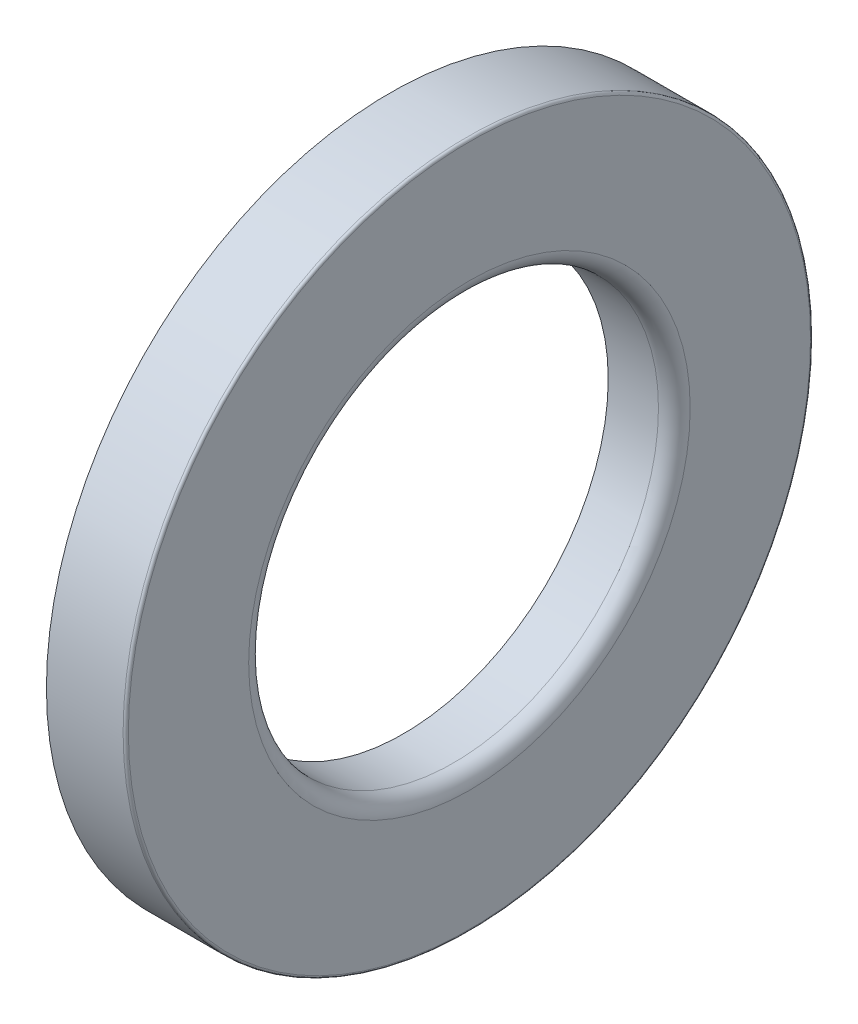
ISO-10303-21;
HEADER;
FILE_DESCRIPTION(('STEP AP214'),'2;1');
FILE_NAME('part.step','',(''),(''),'','','');
FILE_SCHEMA(('AUTOMOTIVE_DESIGN { 1 0 10303 214 1 1 1 1 }'));
ENDSEC;
DATA;
#1=APPLICATION_CONTEXT('core data for automotive mechanical design processes');
#2=APPLICATION_PROTOCOL_DEFINITION('international standard','automotive_design',2000,#1);
#3=PRODUCT_CONTEXT('',#1,'mechanical');
#4=PRODUCT('Part','Part','',(#3));
#5=PRODUCT_RELATED_PRODUCT_CATEGORY('part','',(#4));
#6=PRODUCT_DEFINITION_FORMATION('','',#4);
#7=PRODUCT_DEFINITION_CONTEXT('part definition',#1,'design');
#8=PRODUCT_DEFINITION('design','',#6,#7);
#9=PRODUCT_DEFINITION_SHAPE('','',#8);
#10=(LENGTH_UNIT() NAMED_UNIT(*) SI_UNIT(.MILLI.,.METRE.));
#11=(NAMED_UNIT(*) PLANE_ANGLE_UNIT() SI_UNIT($,.RADIAN.));
#12=(NAMED_UNIT(*) SI_UNIT($,.STERADIAN.) SOLID_ANGLE_UNIT());
#13=UNCERTAINTY_MEASURE_WITH_UNIT(LENGTH_MEASURE(1.E-05),#10,'distance_accuracy_value','');
#14=(GEOMETRIC_REPRESENTATION_CONTEXT(3) GLOBAL_UNCERTAINTY_ASSIGNED_CONTEXT((#13)) GLOBAL_UNIT_ASSIGNED_CONTEXT((#10,
#11,#12)) REPRESENTATION_CONTEXT('',''));
#15=CARTESIAN_POINT('',(0.,0.,0.));
#16=DIRECTION('',(0.,0.,1.));
#17=DIRECTION('',(1.,0.,0.));
#18=AXIS2_PLACEMENT_3D('',#15,#16,#17);
#19=CARTESIAN_POINT('',(-2.5,12.5,-1.11022302462516E-13));
#20=DIRECTION('',(1.,0.,0.));
#21=DIRECTION('',(0.,0.,-1.));
#22=AXIS2_PLACEMENT_3D('',#19,#20,#21);
#23=PLANE('',#22);
#24=CARTESIAN_POINT('',(-2.5,0.,-1.11022302462516E-13));
#25=DIRECTION('',(-1.,0.,0.));
#26=DIRECTION('',(0.,0.,1.));
#27=AXIS2_PLACEMENT_3D('',#24,#25,#26);
#28=CIRCLE('',#27,12.5);
#29=CARTESIAN_POINT('',(-2.5,0.,12.4999999999999));
#30=VERTEX_POINT('',#29);
#31=EDGE_CURVE('E10',#30,#30,#28,.T.);
#32=ORIENTED_EDGE('',*,*,#31,.F.);
#33=EDGE_LOOP('',(#32));
#34=FACE_BOUND('',#33,.T.);
#35=CARTESIAN_POINT('',(-2.5,0.,-1.11022302462516E-13));
#36=DIRECTION('',(-1.,0.,0.));
#37=DIRECTION('',(0.,0.,1.));
#38=AXIS2_PLACEMENT_3D('',#35,#36,#37);
#39=CIRCLE('',#38,13.);
#40=CARTESIAN_POINT('',(-2.5,0.,12.9999999999999));
#41=VERTEX_POINT('',#40);
#42=EDGE_CURVE('E64',#41,#41,#39,.T.);
#43=ORIENTED_EDGE('',*,*,#42,.T.);
#44=EDGE_LOOP('',(#43));
#45=FACE_BOUND('',#44,.T.);
#46=ADVANCED_FACE('F24',(#34,#45),#23,.F.);
#47=CARTESIAN_POINT('',(-5.95642479213908,0.,-2.22044604925031E-13));
#48=DIRECTION('',(-1.,0.,0.));
#49=DIRECTION('',(0.,0.,1.));
#50=AXIS2_PLACEMENT_3D('',#47,#48,#49);
#51=CYLINDRICAL_SURFACE('',#50,12.5);
#52=CARTESIAN_POINT('',(-0.5,0.,-1.11022302462516E-13));
#53=DIRECTION('',(-1.,0.,0.));
#54=DIRECTION('',(0.,0.,1.));
#55=AXIS2_PLACEMENT_3D('',#52,#53,#54);
#56=CIRCLE('',#55,12.5);
#57=CARTESIAN_POINT('',(-0.499999999999999,0.,12.4999999999999));
#58=VERTEX_POINT('',#57);
#59=EDGE_CURVE('E30',#58,#58,#56,.T.);
#60=ORIENTED_EDGE('',*,*,#59,.F.);
#61=EDGE_LOOP('',(#60));
#62=FACE_BOUND('',#61,.T.);
#63=ORIENTED_EDGE('',*,*,#31,.T.);
#64=EDGE_LOOP('',(#63));
#65=FACE_BOUND('',#64,.T.);
#66=ADVANCED_FACE('F125',(#62,#65),#51,.F.);
#67=CARTESIAN_POINT('',(-0.5,0.,-1.11022302462516E-13));
#68=DIRECTION('',(-1.,0.,0.));
#69=DIRECTION('',(0.,0.,1.));
#70=AXIS2_PLACEMENT_3D('',#67,#68,#69);
#71=TOROIDAL_SURFACE('',#70,12.,0.5);
#72=CARTESIAN_POINT('',(0.,0.,0.));
#73=DIRECTION('',(-1.,0.,0.));
#74=DIRECTION('',(0.,0.,1.));
#75=AXIS2_PLACEMENT_3D('',#72,#73,#74);
#76=CIRCLE('',#75,12.);
#77=CARTESIAN_POINT('',(0.,0.,12.));
#78=VERTEX_POINT('',#77);
#79=EDGE_CURVE('E34',#78,#78,#76,.T.);
#80=ORIENTED_EDGE('',*,*,#79,.F.);
#81=EDGE_LOOP('',(#80));
#82=FACE_BOUND('',#81,.T.);
#83=ORIENTED_EDGE('',*,*,#59,.T.);
#84=EDGE_LOOP('',(#83));
#85=FACE_BOUND('',#84,.T.);
#86=ADVANCED_FACE('F120',(#82,#85),#71,.F.);
#87=CARTESIAN_POINT('',(0.,8.75000000000001,-1.11022302462516E-13));
#88=DIRECTION('',(1.,0.,0.));
#89=DIRECTION('',(0.,0.,-1.));
#90=AXIS2_PLACEMENT_3D('',#87,#88,#89);
#91=PLANE('',#90);
#92=CARTESIAN_POINT('',(0.,0.,0.));
#93=DIRECTION('',(-1.,0.,0.));
#94=DIRECTION('',(0.,0.,1.));
#95=AXIS2_PLACEMENT_3D('',#92,#93,#94);
#96=CIRCLE('',#95,8.75);
#97=CARTESIAN_POINT('',(0.,0.,8.75000000000001));
#98=VERTEX_POINT('',#97);
#99=EDGE_CURVE('E38',#98,#98,#96,.T.);
#100=ORIENTED_EDGE('',*,*,#99,.F.);
#101=EDGE_LOOP('',(#100));
#102=FACE_BOUND('',#101,.T.);
#103=ORIENTED_EDGE('',*,*,#79,.T.);
#104=EDGE_LOOP('',(#103));
#105=FACE_BOUND('',#104,.T.);
#106=ADVANCED_FACE('F114',(#102,#105),#91,.F.);
#107=CARTESIAN_POINT('',(-0.5,0.,-1.11022302462516E-13));
#108=DIRECTION('',(-1.,0.,0.));
#109=DIRECTION('',(0.,0.,1.));
#110=AXIS2_PLACEMENT_3D('',#107,#108,#109);
#111=TOROIDAL_SURFACE('',#110,8.75,0.5);
#112=CARTESIAN_POINT('',(-0.5,0.,-1.11022302462516E-13));
#113=DIRECTION('',(-1.,0.,0.));
#114=DIRECTION('',(0.,0.,1.));
#115=AXIS2_PLACEMENT_3D('',#112,#113,#114);
#116=CIRCLE('',#115,8.25);
#117=CARTESIAN_POINT('',(-0.499999999999999,0.,8.2499999999999));
#118=VERTEX_POINT('',#117);
#119=EDGE_CURVE('E43',#118,#118,#116,.T.);
#120=ORIENTED_EDGE('',*,*,#119,.F.);
#121=EDGE_LOOP('',(#120));
#122=FACE_BOUND('',#121,.T.);
#123=ORIENTED_EDGE('',*,*,#99,.T.);
#124=EDGE_LOOP('',(#123));
#125=FACE_BOUND('',#124,.T.);
#126=ADVANCED_FACE('F108',(#122,#125),#111,.F.);
#127=CARTESIAN_POINT('',(-5.95642479213908,0.,-2.22044604925031E-13));
#128=DIRECTION('',(-1.,0.,0.));
#129=DIRECTION('',(0.,0.,1.));
#130=AXIS2_PLACEMENT_3D('',#127,#128,#129);
#131=CYLINDRICAL_SURFACE('',#130,8.25);
#132=CARTESIAN_POINT('',(-2.,0.,-1.11022302462516E-13));
#133=DIRECTION('',(-1.,0.,0.));
#134=DIRECTION('',(0.,0.,1.));
#135=AXIS2_PLACEMENT_3D('',#132,#133,#134);
#136=CIRCLE('',#135,8.25);
#137=CARTESIAN_POINT('',(-2.,0.,8.2499999999999));
#138=VERTEX_POINT('',#137);
#139=EDGE_CURVE('E46',#138,#138,#136,.T.);
#140=ORIENTED_EDGE('',*,*,#139,.F.);
#141=EDGE_LOOP('',(#140));
#142=FACE_BOUND('',#141,.T.);
#143=ORIENTED_EDGE('',*,*,#119,.T.);
#144=EDGE_LOOP('',(#143));
#145=FACE_BOUND('',#144,.T.);
#146=ADVANCED_FACE('F102',(#142,#145),#131,.T.);
#147=CARTESIAN_POINT('',(-2.,8.25000000000001,-1.11022302462516E-13));
#148=DIRECTION('',(1.,0.,0.));
#149=DIRECTION('',(0.,0.,-1.));
#150=AXIS2_PLACEMENT_3D('',#147,#148,#149);
#151=PLANE('',#150);
#152=CARTESIAN_POINT('',(-2.,0.,-1.11022302462516E-13));
#153=DIRECTION('',(-1.,0.,0.));
#154=DIRECTION('',(0.,0.,1.));
#155=AXIS2_PLACEMENT_3D('',#152,#153,#154);
#156=CIRCLE('',#155,7.75);
#157=CARTESIAN_POINT('',(-2.,0.,7.7499999999999));
#158=VERTEX_POINT('',#157);
#159=EDGE_CURVE('E49',#158,#158,#156,.T.);
#160=ORIENTED_EDGE('',*,*,#159,.F.);
#161=EDGE_LOOP('',(#160));
#162=FACE_BOUND('',#161,.T.);
#163=ORIENTED_EDGE('',*,*,#139,.T.);
#164=EDGE_LOOP('',(#163));
#165=FACE_BOUND('',#164,.T.);
#166=ADVANCED_FACE('F96',(#162,#165),#151,.F.);
#167=CARTESIAN_POINT('',(-5.95642479213908,0.,-2.22044604925031E-13));
#168=DIRECTION('',(-1.,0.,0.));
#169=DIRECTION('',(0.,0.,1.));
#170=AXIS2_PLACEMENT_3D('',#167,#168,#169);
#171=CYLINDRICAL_SURFACE('',#170,7.75);
#172=CARTESIAN_POINT('',(-0.100000000000017,0.,-1.11022302462516E-13));
#173=DIRECTION('',(-1.,0.,0.));
#174=DIRECTION('',(0.,0.,1.));
#175=AXIS2_PLACEMENT_3D('',#172,#173,#174);
#176=CIRCLE('',#175,7.75);
#177=CARTESIAN_POINT('',(-0.100000000000016,0.,7.7499999999999));
#178=VERTEX_POINT('',#177);
#179=EDGE_CURVE('E52',#178,#178,#176,.T.);
#180=ORIENTED_EDGE('',*,*,#179,.F.);
#181=EDGE_LOOP('',(#180));
#182=FACE_BOUND('',#181,.T.);
#183=ORIENTED_EDGE('',*,*,#159,.T.);
#184=EDGE_LOOP('',(#183));
#185=FACE_BOUND('',#184,.T.);
#186=ADVANCED_FACE('F90',(#182,#185),#171,.F.);
#187=CARTESIAN_POINT('',(-0.100000000000017,0.,-1.11022302462516E-13));
#188=DIRECTION('',(-1.,0.,0.));
#189=DIRECTION('',(0.,0.,1.));
#190=AXIS2_PLACEMENT_3D('',#187,#188,#189);
#191=TOROIDAL_SURFACE('',#190,8.35,0.6);
#192=CARTESIAN_POINT('',(0.5,0.,0.));
#193=DIRECTION('',(-1.,0.,0.));
#194=DIRECTION('',(0.,0.,1.));
#195=AXIS2_PLACEMENT_3D('',#192,#193,#194);
#196=CIRCLE('',#195,8.35);
#197=CARTESIAN_POINT('',(0.500000000000002,0.,8.35000000000001));
#198=VERTEX_POINT('',#197);
#199=EDGE_CURVE('E55',#198,#198,#196,.T.);
#200=ORIENTED_EDGE('',*,*,#199,.F.);
#201=EDGE_LOOP('',(#200));
#202=FACE_BOUND('',#201,.T.);
#203=ORIENTED_EDGE('',*,*,#179,.T.);
#204=EDGE_LOOP('',(#203));
#205=FACE_BOUND('',#204,.T.);
#206=ADVANCED_FACE('F84',(#202,#205),#191,.T.);
#207=CARTESIAN_POINT('',(0.5,8.35000000000001,0.));
#208=DIRECTION('',(-1.,0.,0.));
#209=DIRECTION('',(0.,0.,1.));
#210=AXIS2_PLACEMENT_3D('',#207,#208,#209);
#211=PLANE('',#210);
#212=CARTESIAN_POINT('',(0.5,0.,0.));
#213=DIRECTION('',(-1.,0.,0.));
#214=DIRECTION('',(0.,0.,1.));
#215=AXIS2_PLACEMENT_3D('',#212,#213,#214);
#216=CIRCLE('',#215,12.9);
#217=CARTESIAN_POINT('',(0.500000000000002,0.,12.9));
#218=VERTEX_POINT('',#217);
#219=EDGE_CURVE('E58',#218,#218,#216,.T.);
#220=ORIENTED_EDGE('',*,*,#219,.F.);
#221=EDGE_LOOP('',(#220));
#222=FACE_BOUND('',#221,.T.);
#223=ORIENTED_EDGE('',*,*,#199,.T.);
#224=EDGE_LOOP('',(#223));
#225=FACE_BOUND('',#224,.T.);
#226=ADVANCED_FACE('F78',(#222,#225),#211,.F.);
#227=CARTESIAN_POINT('',(0.399999999999998,0.,-1.11022302462516E-13));
#228=DIRECTION('',(-1.,0.,0.));
#229=DIRECTION('',(0.,0.,1.));
#230=AXIS2_PLACEMENT_3D('',#227,#228,#229);
#231=TOROIDAL_SURFACE('',#230,12.9,0.0999999999999997);
#232=CARTESIAN_POINT('',(0.399999999999998,0.,-1.11022302462516E-13));
#233=DIRECTION('',(-1.,0.,0.));
#234=DIRECTION('',(0.,0.,1.));
#235=AXIS2_PLACEMENT_3D('',#232,#233,#234);
#236=CIRCLE('',#235,13.);
#237=CARTESIAN_POINT('',(0.399999999999999,0.,12.9999999999999));
#238=VERTEX_POINT('',#237);
#239=EDGE_CURVE('E61',#238,#238,#236,.T.);
#240=ORIENTED_EDGE('',*,*,#239,.F.);
#241=EDGE_LOOP('',(#240));
#242=FACE_BOUND('',#241,.T.);
#243=ORIENTED_EDGE('',*,*,#219,.T.);
#244=EDGE_LOOP('',(#243));
#245=FACE_BOUND('',#244,.T.);
#246=ADVANCED_FACE('F72',(#242,#245),#231,.T.);
#247=CARTESIAN_POINT('',(-5.95642479213908,0.,-2.22044604925031E-13));
#248=DIRECTION('',(-1.,0.,0.));
#249=DIRECTION('',(0.,0.,1.));
#250=AXIS2_PLACEMENT_3D('',#247,#248,#249);
#251=CYLINDRICAL_SURFACE('',#250,13.);
#252=ORIENTED_EDGE('',*,*,#42,.F.);
#253=EDGE_LOOP('',(#252));
#254=FACE_BOUND('',#253,.T.);
#255=ORIENTED_EDGE('',*,*,#239,.T.);
#256=EDGE_LOOP('',(#255));
#257=FACE_BOUND('',#256,.T.);
#258=ADVANCED_FACE('F69',(#254,#257),#251,.T.);
#259=CLOSED_SHELL('',(#46,#66,#86,#106,#126,#146,#166,#186,#206,#226,#246,#258));
#260=MANIFOLD_SOLID_BREP('B2',#259);
#261=ADVANCED_BREP_SHAPE_REPRESENTATION('',(#18,#260),#14);
#262=SHAPE_DEFINITION_REPRESENTATION(#9,#261);
ENDSEC;
END-ISO-10303-21;
